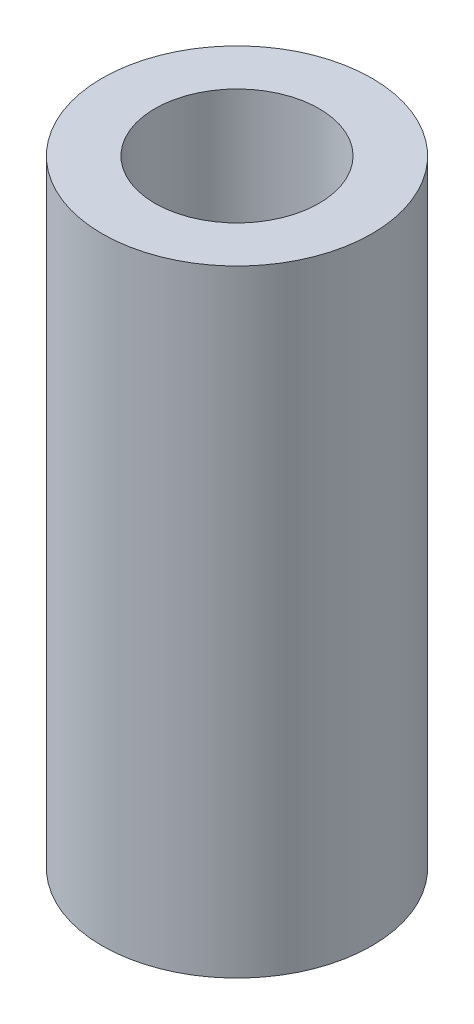
ISO-10303-21;
HEADER;
FILE_DESCRIPTION(('STEP AP214'),'2;1');
FILE_NAME('part.step','',(''),(''),'','','');
FILE_SCHEMA(('AUTOMOTIVE_DESIGN { 1 0 10303 214 1 1 1 1 }'));
ENDSEC;
DATA;
#1=APPLICATION_CONTEXT('core data for automotive mechanical design processes');
#2=APPLICATION_PROTOCOL_DEFINITION('international standard','automotive_design',2000,#1);
#3=PRODUCT_CONTEXT('',#1,'mechanical');
#4=PRODUCT('Part','Part','',(#3));
#5=PRODUCT_RELATED_PRODUCT_CATEGORY('part','',(#4));
#6=PRODUCT_DEFINITION_FORMATION('','',#4);
#7=PRODUCT_DEFINITION_CONTEXT('part definition',#1,'design');
#8=PRODUCT_DEFINITION('design','',#6,#7);
#9=PRODUCT_DEFINITION_SHAPE('','',#8);
#10=(LENGTH_UNIT() NAMED_UNIT(*) SI_UNIT(.MILLI.,.METRE.));
#11=(NAMED_UNIT(*) PLANE_ANGLE_UNIT() SI_UNIT($,.RADIAN.));
#12=(NAMED_UNIT(*) SI_UNIT($,.STERADIAN.) SOLID_ANGLE_UNIT());
#13=UNCERTAINTY_MEASURE_WITH_UNIT(LENGTH_MEASURE(1.E-05),#10,'distance_accuracy_value','');
#14=(GEOMETRIC_REPRESENTATION_CONTEXT(3) GLOBAL_UNCERTAINTY_ASSIGNED_CONTEXT((#13)) GLOBAL_UNIT_ASSIGNED_CONTEXT((#10,
#11,#12)) REPRESENTATION_CONTEXT('',''));
#15=CARTESIAN_POINT('',(0.,0.,0.));
#16=DIRECTION('',(0.,0.,1.));
#17=DIRECTION('',(1.,0.,0.));
#18=AXIS2_PLACEMENT_3D('',#15,#16,#17);
#19=CARTESIAN_POINT('',(0.,57.1768794776334,0.));
#20=DIRECTION('',(0.,-1.,0.));
#21=DIRECTION('',(0.,0.,-1.));
#22=AXIS2_PLACEMENT_3D('',#19,#20,#21);
#23=CYLINDRICAL_SURFACE('',#22,12.5);
#24=CARTESIAN_POINT('',(0.,57.1768794776334,0.));
#25=DIRECTION('',(0.,1.,0.));
#26=DIRECTION('',(0.,0.,1.));
#27=AXIS2_PLACEMENT_3D('',#24,#25,#26);
#28=CIRCLE('',#27,12.5);
#29=CARTESIAN_POINT('',(0.,57.1768794776334,12.5));
#30=VERTEX_POINT('',#29);
#31=EDGE_CURVE('E10',#30,#30,#28,.T.);
#32=ORIENTED_EDGE('',*,*,#31,.F.);
#33=EDGE_LOOP('',(#32));
#34=FACE_BOUND('',#33,.T.);
#35=CARTESIAN_POINT('',(0.,0.,0.));
#36=DIRECTION('',(0.,1.,0.));
#37=DIRECTION('',(0.,0.,1.));
#38=AXIS2_PLACEMENT_3D('',#35,#36,#37);
#39=CIRCLE('',#38,12.5);
#40=CARTESIAN_POINT('',(0.,0.,12.5));
#41=VERTEX_POINT('',#40);
#42=EDGE_CURVE('E37',#41,#41,#39,.T.);
#43=ORIENTED_EDGE('',*,*,#42,.T.);
#44=EDGE_LOOP('',(#43));
#45=FACE_BOUND('',#44,.T.);
#46=ADVANCED_FACE('F40',(#34,#45),#23,.T.);
#47=CARTESIAN_POINT('',(0.,57.1768794776334,0.));
#48=DIRECTION('',(0.,1.,0.));
#49=DIRECTION('',(0.,0.,1.));
#50=AXIS2_PLACEMENT_3D('',#47,#48,#49);
#51=PLANE('',#50);
#52=CARTESIAN_POINT('',(0.,57.1768794776334,0.));
#53=DIRECTION('',(0.,1.,0.));
#54=DIRECTION('',(0.,0.,1.));
#55=AXIS2_PLACEMENT_3D('',#52,#53,#54);
#56=CIRCLE('',#55,7.6112968995528);
#57=CARTESIAN_POINT('',(0.,57.1768794776334,7.6112968995528));
#58=VERTEX_POINT('',#57);
#59=EDGE_CURVE('E50',#58,#58,#56,.T.);
#60=ORIENTED_EDGE('',*,*,#59,.F.);
#61=EDGE_LOOP('',(#60));
#62=FACE_BOUND('',#61,.T.);
#63=ORIENTED_EDGE('',*,*,#31,.T.);
#64=EDGE_LOOP('',(#63));
#65=FACE_BOUND('',#64,.T.);
#66=ADVANCED_FACE('F59',(#62,#65),#51,.T.);
#67=CARTESIAN_POINT('',(0.,0.,0.));
#68=DIRECTION('',(0.,1.,0.));
#69=DIRECTION('',(0.,0.,1.));
#70=AXIS2_PLACEMENT_3D('',#67,#68,#69);
#71=PLANE('',#70);
#72=CARTESIAN_POINT('',(0.,0.,0.));
#73=DIRECTION('',(0.,1.,0.));
#74=DIRECTION('',(0.,0.,1.));
#75=AXIS2_PLACEMENT_3D('',#72,#73,#74);
#76=CIRCLE('',#75,7.6112968995528);
#77=CARTESIAN_POINT('',(0.,0.,7.6112968995528));
#78=VERTEX_POINT('',#77);
#79=EDGE_CURVE('E47',#78,#78,#76,.T.);
#80=ORIENTED_EDGE('',*,*,#79,.T.);
#81=EDGE_LOOP('',(#80));
#82=FACE_BOUND('',#81,.T.);
#83=ORIENTED_EDGE('',*,*,#42,.F.);
#84=EDGE_LOOP('',(#83));
#85=FACE_BOUND('',#84,.T.);
#86=ADVANCED_FACE('F58',(#82,#85),#71,.F.);
#87=CARTESIAN_POINT('',(0.,57.1768794776334,0.));
#88=DIRECTION('',(0.,-1.,0.));
#89=DIRECTION('',(0.,0.,-1.));
#90=AXIS2_PLACEMENT_3D('',#87,#88,#89);
#91=CYLINDRICAL_SURFACE('',#90,7.6112968995528);
#92=ORIENTED_EDGE('',*,*,#59,.T.);
#93=EDGE_LOOP('',(#92));
#94=FACE_BOUND('',#93,.T.);
#95=ORIENTED_EDGE('',*,*,#79,.F.);
#96=EDGE_LOOP('',(#95));
#97=FACE_BOUND('',#96,.T.);
#98=ADVANCED_FACE('F54',(#94,#97),#91,.F.);
#99=CLOSED_SHELL('',(#46,#66,#86,#98));
#100=MANIFOLD_SOLID_BREP('B2',#99);
#101=ADVANCED_BREP_SHAPE_REPRESENTATION('',(#18,#100),#14);
#102=SHAPE_DEFINITION_REPRESENTATION(#9,#101);
ENDSEC;
END-ISO-10303-21;
